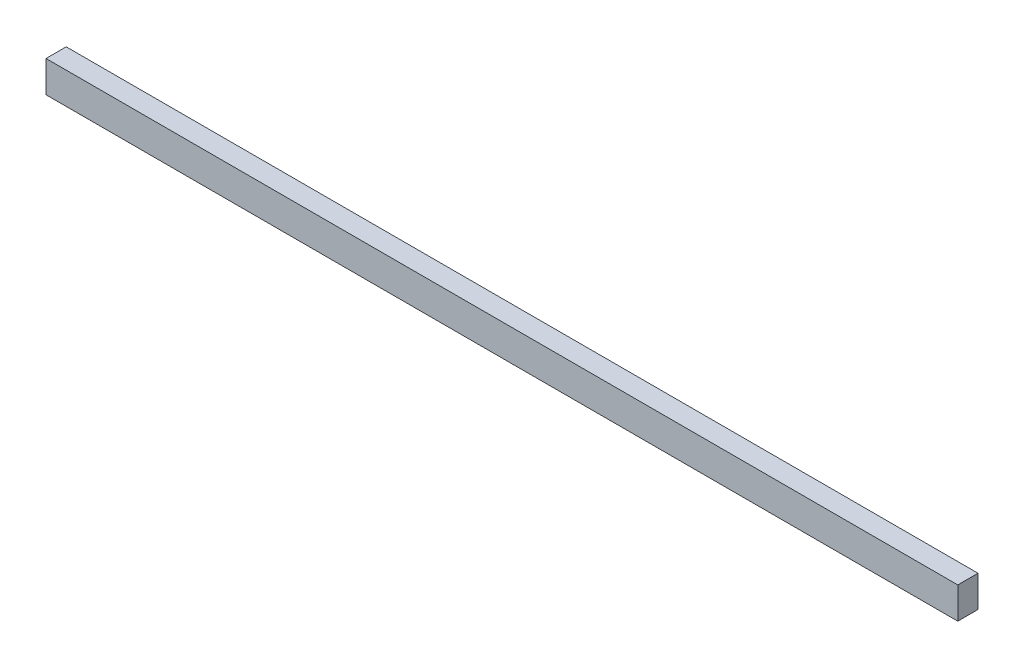
ISO-10303-21;
HEADER;
FILE_DESCRIPTION(('STEP AP214'),'2;1');
FILE_NAME('part.step','',(''),(''),'','','');
FILE_SCHEMA(('AUTOMOTIVE_DESIGN { 1 0 10303 214 1 1 1 1 }'));
ENDSEC;
DATA;
#1=APPLICATION_CONTEXT('core data for automotive mechanical design processes');
#2=APPLICATION_PROTOCOL_DEFINITION('international standard','automotive_design',2000,#1);
#3=PRODUCT_CONTEXT('',#1,'mechanical');
#4=PRODUCT('Part','Part','',(#3));
#5=PRODUCT_RELATED_PRODUCT_CATEGORY('part','',(#4));
#6=PRODUCT_DEFINITION_FORMATION('','',#4);
#7=PRODUCT_DEFINITION_CONTEXT('part definition',#1,'design');
#8=PRODUCT_DEFINITION('design','',#6,#7);
#9=PRODUCT_DEFINITION_SHAPE('','',#8);
#10=(LENGTH_UNIT() NAMED_UNIT(*) SI_UNIT(.MILLI.,.METRE.));
#11=(NAMED_UNIT(*) PLANE_ANGLE_UNIT() SI_UNIT($,.RADIAN.));
#12=(NAMED_UNIT(*) SI_UNIT($,.STERADIAN.) SOLID_ANGLE_UNIT());
#13=UNCERTAINTY_MEASURE_WITH_UNIT(LENGTH_MEASURE(1.E-05),#10,'distance_accuracy_value','');
#14=(GEOMETRIC_REPRESENTATION_CONTEXT(3) GLOBAL_UNCERTAINTY_ASSIGNED_CONTEXT((#13)) GLOBAL_UNIT_ASSIGNED_CONTEXT((#10,
#11,#12)) REPRESENTATION_CONTEXT('',''));
#15=CARTESIAN_POINT('',(0.,0.,0.));
#16=DIRECTION('',(0.,0.,1.));
#17=DIRECTION('',(1.,0.,0.));
#18=AXIS2_PLACEMENT_3D('',#15,#16,#17);
#19=CARTESIAN_POINT('',(2030.,0.,0.));
#20=DIRECTION('',(0.,0.,-1.));
#21=DIRECTION('',(-1.,0.,0.));
#22=AXIS2_PLACEMENT_3D('',#19,#20,#21);
#23=PLANE('',#22);
#24=DIRECTION('',(0.,-1.,0.));
#25=VECTOR('',#24,1.);
#26=CARTESIAN_POINT('',(0.,0.,0.));
#27=LINE('',#26,#25);
#28=CARTESIAN_POINT('',(0.,70.,0.));
#29=VERTEX_POINT('',#28);
#30=CARTESIAN_POINT('',(0.,0.,0.));
#31=VERTEX_POINT('',#30);
#32=EDGE_CURVE('E96',#29,#31,#27,.T.);
#33=ORIENTED_EDGE('',*,*,#32,.T.);
#34=DIRECTION('',(-1.,0.,0.));
#35=VECTOR('',#34,1.);
#36=CARTESIAN_POINT('',(2030.,0.,0.));
#37=LINE('',#36,#35);
#38=CARTESIAN_POINT('',(2030.,0.,0.));
#39=VERTEX_POINT('',#38);
#40=EDGE_CURVE('E11',#39,#31,#37,.T.);
#41=ORIENTED_EDGE('',*,*,#40,.F.);
#42=DIRECTION('',(0.,-1.,0.));
#43=VECTOR('',#42,1.);
#44=CARTESIAN_POINT('',(2030.,0.,0.));
#45=LINE('',#44,#43);
#46=CARTESIAN_POINT('',(2030.,70.,0.));
#47=VERTEX_POINT('',#46);
#48=EDGE_CURVE('E84',#47,#39,#45,.T.);
#49=ORIENTED_EDGE('',*,*,#48,.F.);
#50=DIRECTION('',(-1.,0.,0.));
#51=VECTOR('',#50,1.);
#52=CARTESIAN_POINT('',(2030.,70.,0.));
#53=LINE('',#52,#51);
#54=EDGE_CURVE('E92',#47,#29,#53,.T.);
#55=ORIENTED_EDGE('',*,*,#54,.T.);
#56=EDGE_LOOP('',(#33,#41,#49,#55));
#57=FACE_BOUND('',#56,.T.);
#58=ADVANCED_FACE('F33',(#57),#23,.F.);
#59=CARTESIAN_POINT('',(2030.,0.,0.));
#60=DIRECTION('',(0.,1.,0.));
#61=DIRECTION('',(0.,0.,1.));
#62=AXIS2_PLACEMENT_3D('',#59,#60,#61);
#63=PLANE('',#62);
#64=DIRECTION('',(0.,0.,-1.));
#65=VECTOR('',#64,1.);
#66=CARTESIAN_POINT('',(0.,0.,0.));
#67=LINE('',#66,#65);
#68=CARTESIAN_POINT('',(0.,0.,-45.));
#69=VERTEX_POINT('',#68);
#70=EDGE_CURVE('E88',#31,#69,#67,.T.);
#71=ORIENTED_EDGE('',*,*,#70,.T.);
#72=DIRECTION('',(-1.,0.,0.));
#73=VECTOR('',#72,1.);
#74=CARTESIAN_POINT('',(2030.,0.,-45.));
#75=LINE('',#74,#73);
#76=CARTESIAN_POINT('',(2030.,0.,-45.));
#77=VERTEX_POINT('',#76);
#78=EDGE_CURVE('E41',#77,#69,#75,.T.);
#79=ORIENTED_EDGE('',*,*,#78,.F.);
#80=DIRECTION('',(0.,0.,-1.));
#81=VECTOR('',#80,1.);
#82=CARTESIAN_POINT('',(2030.,0.,0.));
#83=LINE('',#82,#81);
#84=EDGE_CURVE('E79',#39,#77,#83,.T.);
#85=ORIENTED_EDGE('',*,*,#84,.F.);
#86=ORIENTED_EDGE('',*,*,#40,.T.);
#87=EDGE_LOOP('',(#71,#79,#85,#86));
#88=FACE_BOUND('',#87,.T.);
#89=ADVANCED_FACE('F87',(#88),#63,.F.);
#90=CARTESIAN_POINT('',(2030.,0.,-45.));
#91=DIRECTION('',(0.,0.,1.));
#92=DIRECTION('',(1.,0.,0.));
#93=AXIS2_PLACEMENT_3D('',#90,#91,#92);
#94=PLANE('',#93);
#95=DIRECTION('',(0.,1.,0.));
#96=VECTOR('',#95,1.);
#97=CARTESIAN_POINT('',(0.,0.,-45.));
#98=LINE('',#97,#96);
#99=CARTESIAN_POINT('',(0.,70.,-45.));
#100=VERTEX_POINT('',#99);
#101=EDGE_CURVE('E66',#69,#100,#98,.T.);
#102=ORIENTED_EDGE('',*,*,#101,.T.);
#103=DIRECTION('',(-1.,0.,0.));
#104=VECTOR('',#103,1.);
#105=CARTESIAN_POINT('',(2030.,70.,-45.));
#106=LINE('',#105,#104);
#107=CARTESIAN_POINT('',(2030.,70.,-45.));
#108=VERTEX_POINT('',#107);
#109=EDGE_CURVE('E89',#108,#100,#106,.T.);
#110=ORIENTED_EDGE('',*,*,#109,.F.);
#111=DIRECTION('',(0.,1.,0.));
#112=VECTOR('',#111,1.);
#113=CARTESIAN_POINT('',(2030.,0.,-45.));
#114=LINE('',#113,#112);
#115=EDGE_CURVE('E82',#77,#108,#114,.T.);
#116=ORIENTED_EDGE('',*,*,#115,.F.);
#117=ORIENTED_EDGE('',*,*,#78,.T.);
#118=EDGE_LOOP('',(#102,#110,#116,#117));
#119=FACE_BOUND('',#118,.T.);
#120=ADVANCED_FACE('F90',(#119),#94,.F.);
#121=CARTESIAN_POINT('',(2030.,70.,0.));
#122=DIRECTION('',(0.,-1.,0.));
#123=DIRECTION('',(0.,0.,-1.));
#124=AXIS2_PLACEMENT_3D('',#121,#122,#123);
#125=PLANE('',#124);
#126=DIRECTION('',(0.,0.,1.));
#127=VECTOR('',#126,1.);
#128=CARTESIAN_POINT('',(0.,70.,0.));
#129=LINE('',#128,#127);
#130=EDGE_CURVE('E72',#100,#29,#129,.T.);
#131=ORIENTED_EDGE('',*,*,#130,.T.);
#132=ORIENTED_EDGE('',*,*,#54,.F.);
#133=DIRECTION('',(0.,0.,1.));
#134=VECTOR('',#133,1.);
#135=CARTESIAN_POINT('',(2030.,70.,0.));
#136=LINE('',#135,#134);
#137=EDGE_CURVE('E49',#108,#47,#136,.T.);
#138=ORIENTED_EDGE('',*,*,#137,.F.);
#139=ORIENTED_EDGE('',*,*,#109,.T.);
#140=EDGE_LOOP('',(#131,#132,#138,#139));
#141=FACE_BOUND('',#140,.T.);
#142=ADVANCED_FACE('F103',(#141),#125,.F.);
#143=CARTESIAN_POINT('',(2030.,0.,0.));
#144=DIRECTION('',(-1.,0.,0.));
#145=DIRECTION('',(0.,0.,1.));
#146=AXIS2_PLACEMENT_3D('',#143,#144,#145);
#147=PLANE('',#146);
#148=ORIENTED_EDGE('',*,*,#48,.T.);
#149=ORIENTED_EDGE('',*,*,#84,.T.);
#150=ORIENTED_EDGE('',*,*,#115,.T.);
#151=ORIENTED_EDGE('',*,*,#137,.T.);
#152=EDGE_LOOP('',(#148,#149,#150,#151));
#153=FACE_BOUND('',#152,.T.);
#154=ADVANCED_FACE('F80',(#153),#147,.F.);
#155=CARTESIAN_POINT('',(0.,0.,0.));
#156=DIRECTION('',(-1.,0.,0.));
#157=DIRECTION('',(0.,0.,1.));
#158=AXIS2_PLACEMENT_3D('',#155,#156,#157);
#159=PLANE('',#158);
#160=ORIENTED_EDGE('',*,*,#32,.F.);
#161=ORIENTED_EDGE('',*,*,#130,.F.);
#162=ORIENTED_EDGE('',*,*,#101,.F.);
#163=ORIENTED_EDGE('',*,*,#70,.F.);
#164=EDGE_LOOP('',(#160,#161,#162,#163));
#165=FACE_BOUND('',#164,.T.);
#166=ADVANCED_FACE('F106',(#165),#159,.T.);
#167=CLOSED_SHELL('',(#58,#89,#120,#142,#154,#166));
#168=MANIFOLD_SOLID_BREP('B2',#167);
#169=ADVANCED_BREP_SHAPE_REPRESENTATION('',(#18,#168),#14);
#170=SHAPE_DEFINITION_REPRESENTATION(#9,#169);
ENDSEC;
END-ISO-10303-21;
